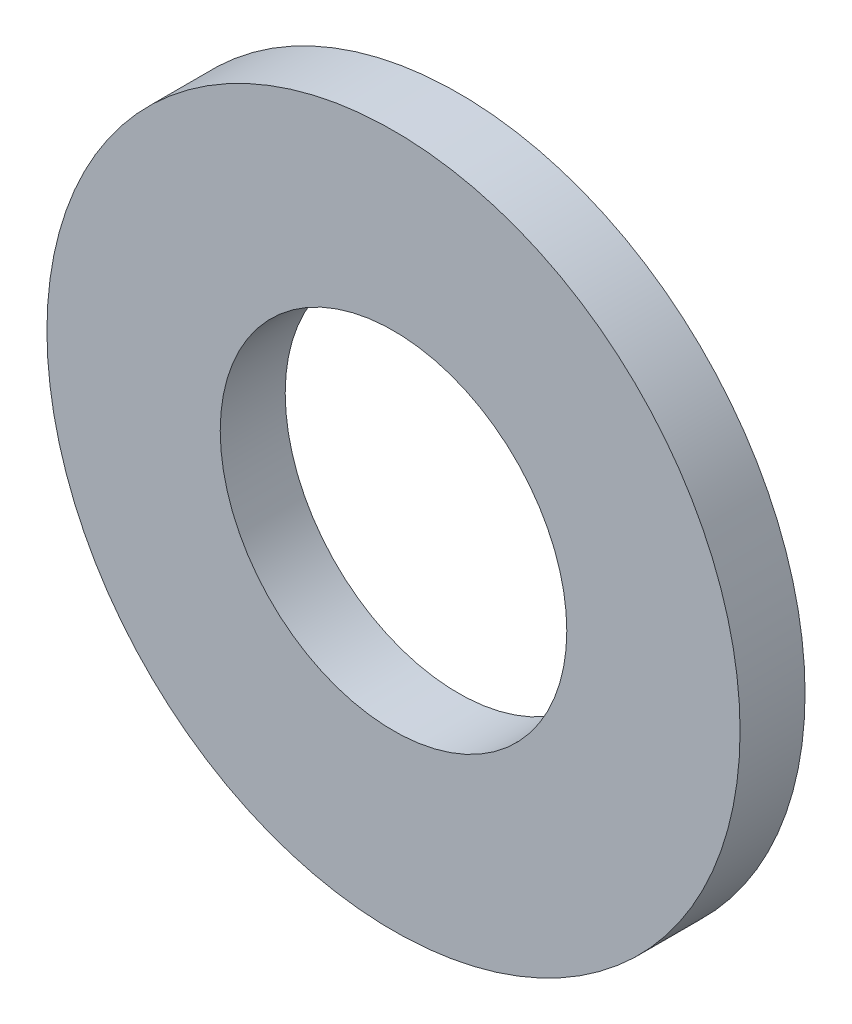
ISO-10303-21;
HEADER;
FILE_DESCRIPTION(('STEP AP214'),'2;1');
FILE_NAME('part.step','',(''),(''),'','','');
FILE_SCHEMA(('AUTOMOTIVE_DESIGN { 1 0 10303 214 1 1 1 1 }'));
ENDSEC;
DATA;
#1=APPLICATION_CONTEXT('core data for automotive mechanical design processes');
#2=APPLICATION_PROTOCOL_DEFINITION('international standard','automotive_design',2000,#1);
#3=PRODUCT_CONTEXT('',#1,'mechanical');
#4=PRODUCT('Part','Part','',(#3));
#5=PRODUCT_RELATED_PRODUCT_CATEGORY('part','',(#4));
#6=PRODUCT_DEFINITION_FORMATION('','',#4);
#7=PRODUCT_DEFINITION_CONTEXT('part definition',#1,'design');
#8=PRODUCT_DEFINITION('design','',#6,#7);
#9=PRODUCT_DEFINITION_SHAPE('','',#8);
#10=(LENGTH_UNIT() NAMED_UNIT(*) SI_UNIT(.MILLI.,.METRE.));
#11=(NAMED_UNIT(*) PLANE_ANGLE_UNIT() SI_UNIT($,.RADIAN.));
#12=(NAMED_UNIT(*) SI_UNIT($,.STERADIAN.) SOLID_ANGLE_UNIT());
#13=UNCERTAINTY_MEASURE_WITH_UNIT(LENGTH_MEASURE(1.E-05),#10,'distance_accuracy_value','');
#14=(GEOMETRIC_REPRESENTATION_CONTEXT(3) GLOBAL_UNCERTAINTY_ASSIGNED_CONTEXT((#13)) GLOBAL_UNIT_ASSIGNED_CONTEXT((#10,
#11,#12)) REPRESENTATION_CONTEXT('',''));
#15=CARTESIAN_POINT('',(0.,0.,0.));
#16=DIRECTION('',(0.,0.,1.));
#17=DIRECTION('',(1.,0.,0.));
#18=AXIS2_PLACEMENT_3D('',#15,#16,#17);
#19=CARTESIAN_POINT('',(0.,0.,1.5));
#20=DIRECTION('',(0.,0.,1.));
#21=DIRECTION('',(1.,0.,0.));
#22=AXIS2_PLACEMENT_3D('',#19,#20,#21);
#23=PLANE('',#22);
#24=CARTESIAN_POINT('',(0.,0.,1.5));
#25=DIRECTION('',(0.,0.,1.));
#26=DIRECTION('',(1.,0.,0.));
#27=AXIS2_PLACEMENT_3D('',#24,#25,#26);
#28=CIRCLE('',#27,8.);
#29=CARTESIAN_POINT('',(8.,0.,1.5));
#30=VERTEX_POINT('',#29);
#31=EDGE_CURVE('E10',#30,#30,#28,.T.);
#32=ORIENTED_EDGE('',*,*,#31,.T.);
#33=EDGE_LOOP('',(#32));
#34=FACE_BOUND('',#33,.T.);
#35=CARTESIAN_POINT('',(0.,0.,1.5));
#36=DIRECTION('',(0.,0.,1.));
#37=DIRECTION('',(1.,0.,0.));
#38=AXIS2_PLACEMENT_3D('',#35,#36,#37);
#39=CIRCLE('',#38,4.);
#40=CARTESIAN_POINT('',(4.,0.,1.5));
#41=VERTEX_POINT('',#40);
#42=EDGE_CURVE('E50',#41,#41,#39,.T.);
#43=ORIENTED_EDGE('',*,*,#42,.F.);
#44=EDGE_LOOP('',(#43));
#45=FACE_BOUND('',#44,.T.);
#46=ADVANCED_FACE('F37',(#34,#45),#23,.T.);
#47=CARTESIAN_POINT('',(0.,0.,0.));
#48=DIRECTION('',(0.,0.,1.));
#49=DIRECTION('',(1.,0.,0.));
#50=AXIS2_PLACEMENT_3D('',#47,#48,#49);
#51=PLANE('',#50);
#52=CARTESIAN_POINT('',(0.,0.,0.));
#53=DIRECTION('',(0.,0.,1.));
#54=DIRECTION('',(1.,0.,0.));
#55=AXIS2_PLACEMENT_3D('',#52,#53,#54);
#56=CIRCLE('',#55,8.);
#57=CARTESIAN_POINT('',(8.,0.,0.));
#58=VERTEX_POINT('',#57);
#59=EDGE_CURVE('E41',#58,#58,#56,.T.);
#60=ORIENTED_EDGE('',*,*,#59,.F.);
#61=EDGE_LOOP('',(#60));
#62=FACE_BOUND('',#61,.T.);
#63=CARTESIAN_POINT('',(0.,0.,0.));
#64=DIRECTION('',(0.,0.,1.));
#65=DIRECTION('',(1.,0.,0.));
#66=AXIS2_PLACEMENT_3D('',#63,#64,#65);
#67=CIRCLE('',#66,4.);
#68=CARTESIAN_POINT('',(4.,0.,0.));
#69=VERTEX_POINT('',#68);
#70=EDGE_CURVE('E52',#69,#69,#67,.T.);
#71=ORIENTED_EDGE('',*,*,#70,.T.);
#72=EDGE_LOOP('',(#71));
#73=FACE_BOUND('',#72,.T.);
#74=ADVANCED_FACE('F64',(#62,#73),#51,.F.);
#75=CARTESIAN_POINT('',(0.,0.,1.5));
#76=DIRECTION('',(0.,0.,-1.));
#77=DIRECTION('',(-1.,0.,0.));
#78=AXIS2_PLACEMENT_3D('',#75,#76,#77);
#79=CYLINDRICAL_SURFACE('',#78,8.);
#80=ORIENTED_EDGE('',*,*,#31,.F.);
#81=EDGE_LOOP('',(#80));
#82=FACE_BOUND('',#81,.T.);
#83=ORIENTED_EDGE('',*,*,#59,.T.);
#84=EDGE_LOOP('',(#83));
#85=FACE_BOUND('',#84,.T.);
#86=ADVANCED_FACE('F39',(#82,#85),#79,.T.);
#87=CARTESIAN_POINT('',(0.,0.,1.5));
#88=DIRECTION('',(0.,0.,-1.));
#89=DIRECTION('',(-1.,0.,0.));
#90=AXIS2_PLACEMENT_3D('',#87,#88,#89);
#91=CYLINDRICAL_SURFACE('',#90,4.);
#92=ORIENTED_EDGE('',*,*,#42,.T.);
#93=EDGE_LOOP('',(#92));
#94=FACE_BOUND('',#93,.T.);
#95=ORIENTED_EDGE('',*,*,#70,.F.);
#96=EDGE_LOOP('',(#95));
#97=FACE_BOUND('',#96,.T.);
#98=ADVANCED_FACE('F60',(#94,#97),#91,.F.);
#99=CLOSED_SHELL('',(#46,#74,#86,#98));
#100=MANIFOLD_SOLID_BREP('B2',#99);
#101=ADVANCED_BREP_SHAPE_REPRESENTATION('',(#18,#100),#14);
#102=SHAPE_DEFINITION_REPRESENTATION(#9,#101);
ENDSEC;
END-ISO-10303-21;
